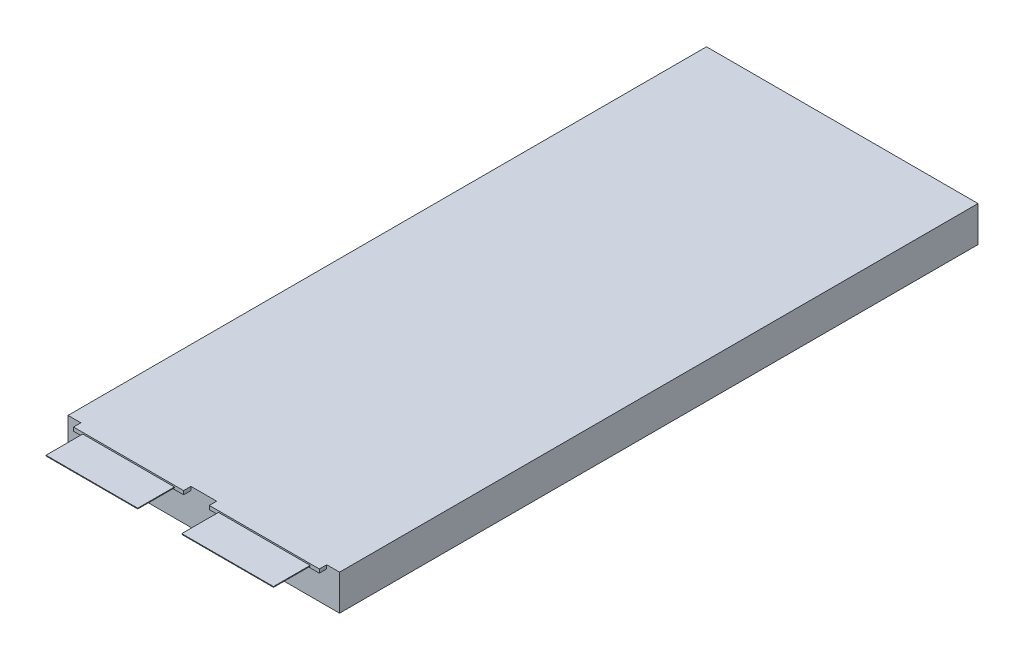
ISO-10303-21;
HEADER;
FILE_DESCRIPTION(('STEP AP214'),'2;1');
FILE_NAME('part.step','',(''),(''),'','','');
FILE_SCHEMA(('AUTOMOTIVE_DESIGN { 1 0 10303 214 1 1 1 1 }'));
ENDSEC;
DATA;
#1=APPLICATION_CONTEXT('core data for automotive mechanical design processes');
#2=APPLICATION_PROTOCOL_DEFINITION('international standard','automotive_design',2000,#1);
#3=PRODUCT_CONTEXT('',#1,'mechanical');
#4=PRODUCT('Part','Part','',(#3));
#5=PRODUCT_RELATED_PRODUCT_CATEGORY('part','',(#4));
#6=PRODUCT_DEFINITION_FORMATION('','',#4);
#7=PRODUCT_DEFINITION_CONTEXT('part definition',#1,'design');
#8=PRODUCT_DEFINITION('design','',#6,#7);
#9=PRODUCT_DEFINITION_SHAPE('','',#8);
#10=(LENGTH_UNIT() NAMED_UNIT(*) SI_UNIT(.MILLI.,.METRE.));
#11=(NAMED_UNIT(*) PLANE_ANGLE_UNIT() SI_UNIT($,.RADIAN.));
#12=(NAMED_UNIT(*) SI_UNIT($,.STERADIAN.) SOLID_ANGLE_UNIT());
#13=UNCERTAINTY_MEASURE_WITH_UNIT(LENGTH_MEASURE(1.E-05),#10,'distance_accuracy_value','');
#14=(GEOMETRIC_REPRESENTATION_CONTEXT(3) GLOBAL_UNCERTAINTY_ASSIGNED_CONTEXT((#13)) GLOBAL_UNIT_ASSIGNED_CONTEXT((#10,
#11,#12)) REPRESENTATION_CONTEXT('',''));
#15=CARTESIAN_POINT('',(0.,0.,0.));
#16=DIRECTION('',(0.,0.,1.));
#17=DIRECTION('',(1.,0.,0.));
#18=AXIS2_PLACEMENT_3D('',#15,#16,#17);
#19=CARTESIAN_POINT('',(0.,0.,176.));
#20=DIRECTION('',(0.,0.,1.));
#21=DIRECTION('',(1.,0.,0.));
#22=AXIS2_PLACEMENT_3D('',#19,#20,#21);
#23=PLANE('',#22);
#24=DIRECTION('',(1.,0.,0.));
#25=VECTOR('',#24,1.);
#26=CARTESIAN_POINT('',(40.5,-1.,176.));
#27=LINE('',#26,#25);
#28=CARTESIAN_POINT('',(40.5,-1.,176.));
#29=VERTEX_POINT('',#28);
#30=CARTESIAN_POINT('',(70.5,-1.,176.));
#31=VERTEX_POINT('',#30);
#32=EDGE_CURVE('E235',#29,#31,#27,.T.);
#33=ORIENTED_EDGE('',*,*,#32,.T.);
#34=DIRECTION('',(0.,1.,0.));
#35=VECTOR('',#34,1.);
#36=CARTESIAN_POINT('',(70.5,-1.,176.));
#37=LINE('',#36,#35);
#38=CARTESIAN_POINT('',(70.5,0.,176.));
#39=VERTEX_POINT('',#38);
#40=EDGE_CURVE('E238',#31,#39,#37,.T.);
#41=ORIENTED_EDGE('',*,*,#40,.T.);
#42=DIRECTION('',(-1.,0.,0.));
#43=VECTOR('',#42,1.);
#44=CARTESIAN_POINT('',(55.5,0.,176.));
#45=LINE('',#44,#43);
#46=CARTESIAN_POINT('',(40.5,0.,176.));
#47=VERTEX_POINT('',#46);
#48=EDGE_CURVE('E241',#39,#47,#45,.T.);
#49=ORIENTED_EDGE('',*,*,#48,.T.);
#50=DIRECTION('',(0.,-1.,0.));
#51=VECTOR('',#50,1.);
#52=CARTESIAN_POINT('',(40.5,0.,176.));
#53=LINE('',#52,#51);
#54=EDGE_CURVE('E243',#47,#29,#53,.T.);
#55=ORIENTED_EDGE('',*,*,#54,.T.);
#56=EDGE_LOOP('',(#33,#41,#49,#55));
#57=FACE_BOUND('',#56,.T.);
#58=DIRECTION('',(1.,0.,0.));
#59=VECTOR('',#58,1.);
#60=CARTESIAN_POINT('',(43.,-0.599999999999999,176.));
#61=LINE('',#60,#59);
#62=CARTESIAN_POINT('',(43.,-0.599999999999999,176.));
#63=VERTEX_POINT('',#62);
#64=CARTESIAN_POINT('',(68.,-0.599999999999999,176.));
#65=VERTEX_POINT('',#64);
#66=EDGE_CURVE('E52',#63,#65,#61,.T.);
#67=ORIENTED_EDGE('',*,*,#66,.F.);
#68=DIRECTION('',(0.,-1.,0.));
#69=VECTOR('',#68,1.);
#70=CARTESIAN_POINT('',(43.,-0.399999999999999,176.));
#71=LINE('',#70,#69);
#72=CARTESIAN_POINT('',(43.,-0.399999999999999,176.));
#73=VERTEX_POINT('',#72);
#74=EDGE_CURVE('E195',#73,#63,#71,.T.);
#75=ORIENTED_EDGE('',*,*,#74,.F.);
#76=DIRECTION('',(1.,0.,0.));
#77=VECTOR('',#76,1.);
#78=CARTESIAN_POINT('',(43.,-0.399999999999999,176.));
#79=LINE('',#78,#77);
#80=CARTESIAN_POINT('',(68.,-0.399999999999999,176.));
#81=VERTEX_POINT('',#80);
#82=EDGE_CURVE('E192',#73,#81,#79,.T.);
#83=ORIENTED_EDGE('',*,*,#82,.T.);
#84=DIRECTION('',(0.,-1.,0.));
#85=VECTOR('',#84,1.);
#86=CARTESIAN_POINT('',(68.,-0.399999999999999,176.));
#87=LINE('',#86,#85);
#88=EDGE_CURVE('E57',#81,#65,#87,.T.);
#89=ORIENTED_EDGE('',*,*,#88,.T.);
#90=EDGE_LOOP('',(#67,#75,#83,#89));
#91=FACE_BOUND('',#90,.T.);
#92=ADVANCED_FACE('F37',(#57,#91),#23,.T.);
#93=CARTESIAN_POINT('',(0.,0.,176.));
#94=DIRECTION('',(0.,0.,1.));
#95=DIRECTION('',(1.,0.,0.));
#96=AXIS2_PLACEMENT_3D('',#93,#94,#95);
#97=PLANE('',#96);
#98=DIRECTION('',(1.,0.,0.));
#99=VECTOR('',#98,1.);
#100=CARTESIAN_POINT('',(3.5,-1.,176.));
#101=LINE('',#100,#99);
#102=CARTESIAN_POINT('',(3.5,-1.,176.));
#103=VERTEX_POINT('',#102);
#104=CARTESIAN_POINT('',(33.5,-1.,176.));
#105=VERTEX_POINT('',#104);
#106=EDGE_CURVE('E261',#103,#105,#101,.T.);
#107=ORIENTED_EDGE('',*,*,#106,.T.);
#108=DIRECTION('',(0.,1.,0.));
#109=VECTOR('',#108,1.);
#110=CARTESIAN_POINT('',(33.5,-1.,176.));
#111=LINE('',#110,#109);
#112=CARTESIAN_POINT('',(33.5,0.,176.));
#113=VERTEX_POINT('',#112);
#114=EDGE_CURVE('E264',#105,#113,#111,.T.);
#115=ORIENTED_EDGE('',*,*,#114,.T.);
#116=DIRECTION('',(-1.,0.,0.));
#117=VECTOR('',#116,1.);
#118=CARTESIAN_POINT('',(18.5,0.,176.));
#119=LINE('',#118,#117);
#120=CARTESIAN_POINT('',(3.5,0.,176.));
#121=VERTEX_POINT('',#120);
#122=EDGE_CURVE('E267',#113,#121,#119,.T.);
#123=ORIENTED_EDGE('',*,*,#122,.T.);
#124=DIRECTION('',(0.,-1.,0.));
#125=VECTOR('',#124,1.);
#126=CARTESIAN_POINT('',(3.5,0.,176.));
#127=LINE('',#126,#125);
#128=EDGE_CURVE('E269',#121,#103,#127,.T.);
#129=ORIENTED_EDGE('',*,*,#128,.T.);
#130=EDGE_LOOP('',(#107,#115,#123,#129));
#131=FACE_BOUND('',#130,.T.);
#132=DIRECTION('',(1.,0.,0.));
#133=VECTOR('',#132,1.);
#134=CARTESIAN_POINT('',(6.,-0.600000000000005,176.));
#135=LINE('',#134,#133);
#136=CARTESIAN_POINT('',(6.,-0.600000000000005,176.));
#137=VERTEX_POINT('',#136);
#138=CARTESIAN_POINT('',(31.,-0.600000000000005,176.));
#139=VERTEX_POINT('',#138);
#140=EDGE_CURVE('E199',#137,#139,#135,.T.);
#141=ORIENTED_EDGE('',*,*,#140,.F.);
#142=DIRECTION('',(0.,-1.,0.));
#143=VECTOR('',#142,1.);
#144=CARTESIAN_POINT('',(6.,-0.400000000000005,176.));
#145=LINE('',#144,#143);
#146=CARTESIAN_POINT('',(6.,-0.400000000000005,176.));
#147=VERTEX_POINT('',#146);
#148=EDGE_CURVE('E196',#147,#137,#145,.T.);
#149=ORIENTED_EDGE('',*,*,#148,.F.);
#150=DIRECTION('',(1.,0.,0.));
#151=VECTOR('',#150,1.);
#152=CARTESIAN_POINT('',(6.,-0.400000000000005,176.));
#153=LINE('',#152,#151);
#154=CARTESIAN_POINT('',(31.,-0.400000000000005,176.));
#155=VERTEX_POINT('',#154);
#156=EDGE_CURVE('E209',#147,#155,#153,.T.);
#157=ORIENTED_EDGE('',*,*,#156,.T.);
#158=DIRECTION('',(0.,-1.,0.));
#159=VECTOR('',#158,1.);
#160=CARTESIAN_POINT('',(31.,-0.400000000000005,176.));
#161=LINE('',#160,#159);
#162=EDGE_CURVE('E220',#155,#139,#161,.T.);
#163=ORIENTED_EDGE('',*,*,#162,.T.);
#164=EDGE_LOOP('',(#141,#149,#157,#163));
#165=FACE_BOUND('',#164,.T.);
#166=ADVANCED_FACE('F350',(#131,#165),#97,.T.);
#167=CARTESIAN_POINT('',(0.,0.,174.));
#168=DIRECTION('',(0.,0.,1.));
#169=DIRECTION('',(1.,0.,0.));
#170=AXIS2_PLACEMENT_3D('',#167,#168,#169);
#171=PLANE('',#170);
#172=DIRECTION('',(-1.,0.,0.));
#173=VECTOR('',#172,1.);
#174=CARTESIAN_POINT('',(0.,0.,174.));
#175=LINE('',#174,#173);
#176=CARTESIAN_POINT('',(74.,0.,174.));
#177=VERTEX_POINT('',#176);
#178=CARTESIAN_POINT('',(70.5,0.,174.));
#179=VERTEX_POINT('',#178);
#180=EDGE_CURVE('E300',#177,#179,#175,.T.);
#181=ORIENTED_EDGE('',*,*,#180,.T.);
#182=DIRECTION('',(0.,1.,0.));
#183=VECTOR('',#182,1.);
#184=CARTESIAN_POINT('',(70.5,-1.,174.));
#185=LINE('',#184,#183);
#186=CARTESIAN_POINT('',(70.5,-1.,174.));
#187=VERTEX_POINT('',#186);
#188=EDGE_CURVE('E248',#187,#179,#185,.T.);
#189=ORIENTED_EDGE('',*,*,#188,.F.);
#190=DIRECTION('',(1.,0.,0.));
#191=VECTOR('',#190,1.);
#192=CARTESIAN_POINT('',(40.5,-1.,174.));
#193=LINE('',#192,#191);
#194=CARTESIAN_POINT('',(40.5,-1.,174.));
#195=VERTEX_POINT('',#194);
#196=EDGE_CURVE('E234',#195,#187,#193,.T.);
#197=ORIENTED_EDGE('',*,*,#196,.F.);
#198=DIRECTION('',(0.,-1.,0.));
#199=VECTOR('',#198,1.);
#200=CARTESIAN_POINT('',(40.5,0.,174.));
#201=LINE('',#200,#199);
#202=CARTESIAN_POINT('',(40.5,0.,174.));
#203=VERTEX_POINT('',#202);
#204=EDGE_CURVE('E239',#203,#195,#201,.T.);
#205=ORIENTED_EDGE('',*,*,#204,.F.);
#206=CARTESIAN_POINT('',(33.5,0.,174.));
#207=VERTEX_POINT('',#206);
#208=EDGE_CURVE('E304',#203,#207,#175,.T.);
#209=ORIENTED_EDGE('',*,*,#208,.T.);
#210=DIRECTION('',(0.,1.,0.));
#211=VECTOR('',#210,1.);
#212=CARTESIAN_POINT('',(33.5,-1.,174.));
#213=LINE('',#212,#211);
#214=CARTESIAN_POINT('',(33.5,-1.,174.));
#215=VERTEX_POINT('',#214);
#216=EDGE_CURVE('E274',#215,#207,#213,.T.);
#217=ORIENTED_EDGE('',*,*,#216,.F.);
#218=DIRECTION('',(1.,0.,0.));
#219=VECTOR('',#218,1.);
#220=CARTESIAN_POINT('',(3.5,-1.,174.));
#221=LINE('',#220,#219);
#222=CARTESIAN_POINT('',(3.5,-1.,174.));
#223=VERTEX_POINT('',#222);
#224=EDGE_CURVE('E260',#223,#215,#221,.T.);
#225=ORIENTED_EDGE('',*,*,#224,.F.);
#226=DIRECTION('',(0.,-1.,0.));
#227=VECTOR('',#226,1.);
#228=CARTESIAN_POINT('',(3.5,0.,174.));
#229=LINE('',#228,#227);
#230=CARTESIAN_POINT('',(3.5,0.,174.));
#231=VERTEX_POINT('',#230);
#232=EDGE_CURVE('E265',#231,#223,#229,.T.);
#233=ORIENTED_EDGE('',*,*,#232,.F.);
#234=CARTESIAN_POINT('',(0.,0.,174.));
#235=VERTEX_POINT('',#234);
#236=EDGE_CURVE('E299',#231,#235,#175,.T.);
#237=ORIENTED_EDGE('',*,*,#236,.T.);
#238=DIRECTION('',(0.,-1.,0.));
#239=VECTOR('',#238,1.);
#240=CARTESIAN_POINT('',(0.,0.,174.));
#241=LINE('',#240,#239);
#242=CARTESIAN_POINT('',(0.,-9.7,174.));
#243=VERTEX_POINT('',#242);
#244=EDGE_CURVE('E291',#235,#243,#241,.T.);
#245=ORIENTED_EDGE('',*,*,#244,.T.);
#246=DIRECTION('',(1.,0.,0.));
#247=VECTOR('',#246,1.);
#248=CARTESIAN_POINT('',(0.,-9.7,174.));
#249=LINE('',#248,#247);
#250=CARTESIAN_POINT('',(74.,-9.7,174.));
#251=VERTEX_POINT('',#250);
#252=EDGE_CURVE('E294',#243,#251,#249,.T.);
#253=ORIENTED_EDGE('',*,*,#252,.T.);
#254=DIRECTION('',(0.,1.,0.));
#255=VECTOR('',#254,1.);
#256=CARTESIAN_POINT('',(74.,0.,174.));
#257=LINE('',#256,#255);
#258=EDGE_CURVE('E297',#251,#177,#257,.T.);
#259=ORIENTED_EDGE('',*,*,#258,.T.);
#260=EDGE_LOOP('',(#181,#189,#197,#205,#209,#217,#225,#233,#237,#245,#253,#259));
#261=FACE_BOUND('',#260,.T.);
#262=ADVANCED_FACE('F337',(#261),#171,.T.);
#263=CARTESIAN_POINT('',(0.,0.,174.));
#264=DIRECTION('',(1.,0.,0.));
#265=DIRECTION('',(0.,1.,0.));
#266=AXIS2_PLACEMENT_3D('',#263,#264,#265);
#267=PLANE('',#266);
#268=DIRECTION('',(0.,-1.,0.));
#269=VECTOR('',#268,1.);
#270=CARTESIAN_POINT('',(0.,0.,0.));
#271=LINE('',#270,#269);
#272=CARTESIAN_POINT('',(0.,0.,0.));
#273=VERTEX_POINT('',#272);
#274=CARTESIAN_POINT('',(0.,-9.7,0.));
#275=VERTEX_POINT('',#274);
#276=EDGE_CURVE('E290',#273,#275,#271,.T.);
#277=ORIENTED_EDGE('',*,*,#276,.T.);
#278=DIRECTION('',(0.,0.,-1.));
#279=VECTOR('',#278,1.);
#280=CARTESIAN_POINT('',(0.,-9.7,174.));
#281=LINE('',#280,#279);
#282=EDGE_CURVE('E11',#243,#275,#281,.T.);
#283=ORIENTED_EDGE('',*,*,#282,.F.);
#284=ORIENTED_EDGE('',*,*,#244,.F.);
#285=DIRECTION('',(0.,0.,-1.));
#286=VECTOR('',#285,1.);
#287=CARTESIAN_POINT('',(0.,0.,174.));
#288=LINE('',#287,#286);
#289=EDGE_CURVE('E303',#235,#273,#288,.T.);
#290=ORIENTED_EDGE('',*,*,#289,.T.);
#291=EDGE_LOOP('',(#277,#283,#284,#290));
#292=FACE_BOUND('',#291,.T.);
#293=ADVANCED_FACE('F39',(#292),#267,.F.);
#294=CARTESIAN_POINT('',(0.,-9.7,174.));
#295=DIRECTION('',(0.,1.,0.));
#296=DIRECTION('',(0.,0.,1.));
#297=AXIS2_PLACEMENT_3D('',#294,#295,#296);
#298=PLANE('',#297);
#299=DIRECTION('',(1.,0.,0.));
#300=VECTOR('',#299,1.);
#301=CARTESIAN_POINT('',(0.,-9.7,0.));
#302=LINE('',#301,#300);
#303=CARTESIAN_POINT('',(74.,-9.7,0.));
#304=VERTEX_POINT('',#303);
#305=EDGE_CURVE('E307',#275,#304,#302,.T.);
#306=ORIENTED_EDGE('',*,*,#305,.T.);
#307=DIRECTION('',(0.,0.,-1.));
#308=VECTOR('',#307,1.);
#309=CARTESIAN_POINT('',(74.,-9.7,174.));
#310=LINE('',#309,#308);
#311=EDGE_CURVE('E45',#251,#304,#310,.T.);
#312=ORIENTED_EDGE('',*,*,#311,.F.);
#313=ORIENTED_EDGE('',*,*,#252,.F.);
#314=ORIENTED_EDGE('',*,*,#282,.T.);
#315=EDGE_LOOP('',(#306,#312,#313,#314));
#316=FACE_BOUND('',#315,.T.);
#317=ADVANCED_FACE('F563',(#316),#298,.F.);
#318=CARTESIAN_POINT('',(74.,0.,174.));
#319=DIRECTION('',(-1.,0.,0.));
#320=DIRECTION('',(0.,0.,1.));
#321=AXIS2_PLACEMENT_3D('',#318,#319,#320);
#322=PLANE('',#321);
#323=DIRECTION('',(0.,1.,0.));
#324=VECTOR('',#323,1.);
#325=CARTESIAN_POINT('',(74.,0.,0.));
#326=LINE('',#325,#324);
#327=CARTESIAN_POINT('',(74.,0.,0.));
#328=VERTEX_POINT('',#327);
#329=EDGE_CURVE('E309',#304,#328,#326,.T.);
#330=ORIENTED_EDGE('',*,*,#329,.T.);
#331=DIRECTION('',(0.,0.,-1.));
#332=VECTOR('',#331,1.);
#333=CARTESIAN_POINT('',(74.,0.,174.));
#334=LINE('',#333,#332);
#335=EDGE_CURVE('E314',#177,#328,#334,.T.);
#336=ORIENTED_EDGE('',*,*,#335,.F.);
#337=ORIENTED_EDGE('',*,*,#258,.F.);
#338=ORIENTED_EDGE('',*,*,#311,.T.);
#339=EDGE_LOOP('',(#330,#336,#337,#338));
#340=FACE_BOUND('',#339,.T.);
#341=ADVANCED_FACE('F321',(#340),#322,.F.);
#342=CARTESIAN_POINT('',(0.,0.,174.));
#343=DIRECTION('',(0.,-1.,0.));
#344=DIRECTION('',(0.,0.,-1.));
#345=AXIS2_PLACEMENT_3D('',#342,#343,#344);
#346=PLANE('',#345);
#347=DIRECTION('',(-1.,0.,0.));
#348=VECTOR('',#347,1.);
#349=CARTESIAN_POINT('',(0.,0.,0.));
#350=LINE('',#349,#348);
#351=EDGE_CURVE('E295',#328,#273,#350,.T.);
#352=ORIENTED_EDGE('',*,*,#351,.T.);
#353=ORIENTED_EDGE('',*,*,#289,.F.);
#354=ORIENTED_EDGE('',*,*,#236,.F.);
#355=DIRECTION('',(0.,0.,-1.));
#356=VECTOR('',#355,1.);
#357=CARTESIAN_POINT('',(3.5,0.,176.));
#358=LINE('',#357,#356);
#359=EDGE_CURVE('E281',#121,#231,#358,.T.);
#360=ORIENTED_EDGE('',*,*,#359,.F.);
#361=ORIENTED_EDGE('',*,*,#122,.F.);
#362=DIRECTION('',(0.,0.,-1.));
#363=VECTOR('',#362,1.);
#364=CARTESIAN_POINT('',(33.5,0.,176.));
#365=LINE('',#364,#363);
#366=EDGE_CURVE('E284',#113,#207,#365,.T.);
#367=ORIENTED_EDGE('',*,*,#366,.T.);
#368=ORIENTED_EDGE('',*,*,#208,.F.);
#369=DIRECTION('',(0.,0.,-1.));
#370=VECTOR('',#369,1.);
#371=CARTESIAN_POINT('',(40.5,0.,176.));
#372=LINE('',#371,#370);
#373=EDGE_CURVE('E253',#47,#203,#372,.T.);
#374=ORIENTED_EDGE('',*,*,#373,.F.);
#375=ORIENTED_EDGE('',*,*,#48,.F.);
#376=DIRECTION('',(0.,0.,-1.));
#377=VECTOR('',#376,1.);
#378=CARTESIAN_POINT('',(70.5,0.,176.));
#379=LINE('',#378,#377);
#380=EDGE_CURVE('E255',#39,#179,#379,.T.);
#381=ORIENTED_EDGE('',*,*,#380,.T.);
#382=ORIENTED_EDGE('',*,*,#180,.F.);
#383=ORIENTED_EDGE('',*,*,#335,.T.);
#384=EDGE_LOOP('',(#352,#353,#354,#360,#361,#367,#368,#374,#375,#381,#382,#383));
#385=FACE_BOUND('',#384,.T.);
#386=ADVANCED_FACE('F330',(#385),#346,.F.);
#387=CARTESIAN_POINT('',(0.,0.,0.));
#388=DIRECTION('',(0.,0.,1.));
#389=DIRECTION('',(1.,0.,0.));
#390=AXIS2_PLACEMENT_3D('',#387,#388,#389);
#391=PLANE('',#390);
#392=ORIENTED_EDGE('',*,*,#276,.F.);
#393=ORIENTED_EDGE('',*,*,#351,.F.);
#394=ORIENTED_EDGE('',*,*,#329,.F.);
#395=ORIENTED_EDGE('',*,*,#305,.F.);
#396=EDGE_LOOP('',(#392,#393,#394,#395));
#397=FACE_BOUND('',#396,.T.);
#398=ADVANCED_FACE('F327',(#397),#391,.F.);
#399=CARTESIAN_POINT('',(3.5,-1.,176.));
#400=DIRECTION('',(0.,1.,0.));
#401=DIRECTION('',(0.,0.,1.));
#402=AXIS2_PLACEMENT_3D('',#399,#400,#401);
#403=PLANE('',#402);
#404=ORIENTED_EDGE('',*,*,#224,.T.);
#405=DIRECTION('',(0.,0.,-1.));
#406=VECTOR('',#405,1.);
#407=CARTESIAN_POINT('',(33.5,-1.,176.));
#408=LINE('',#407,#406);
#409=EDGE_CURVE('E287',#105,#215,#408,.T.);
#410=ORIENTED_EDGE('',*,*,#409,.F.);
#411=ORIENTED_EDGE('',*,*,#106,.F.);
#412=DIRECTION('',(0.,0.,-1.));
#413=VECTOR('',#412,1.);
#414=CARTESIAN_POINT('',(3.5,-1.,176.));
#415=LINE('',#414,#413);
#416=EDGE_CURVE('E271',#103,#223,#415,.T.);
#417=ORIENTED_EDGE('',*,*,#416,.T.);
#418=EDGE_LOOP('',(#404,#410,#411,#417));
#419=FACE_BOUND('',#418,.T.);
#420=ADVANCED_FACE('F355',(#419),#403,.F.);
#421=CARTESIAN_POINT('',(33.5,-1.,176.));
#422=DIRECTION('',(-1.,0.,0.));
#423=DIRECTION('',(0.,0.,1.));
#424=AXIS2_PLACEMENT_3D('',#421,#422,#423);
#425=PLANE('',#424);
#426=ORIENTED_EDGE('',*,*,#216,.T.);
#427=ORIENTED_EDGE('',*,*,#366,.F.);
#428=ORIENTED_EDGE('',*,*,#114,.F.);
#429=ORIENTED_EDGE('',*,*,#409,.T.);
#430=EDGE_LOOP('',(#426,#427,#428,#429));
#431=FACE_BOUND('',#430,.T.);
#432=ADVANCED_FACE('F345',(#431),#425,.F.);
#433=CARTESIAN_POINT('',(3.5,0.,176.));
#434=DIRECTION('',(1.,0.,0.));
#435=DIRECTION('',(0.,0.,-1.));
#436=AXIS2_PLACEMENT_3D('',#433,#434,#435);
#437=PLANE('',#436);
#438=ORIENTED_EDGE('',*,*,#232,.T.);
#439=ORIENTED_EDGE('',*,*,#416,.F.);
#440=ORIENTED_EDGE('',*,*,#128,.F.);
#441=ORIENTED_EDGE('',*,*,#359,.T.);
#442=EDGE_LOOP('',(#438,#439,#440,#441));
#443=FACE_BOUND('',#442,.T.);
#444=ADVANCED_FACE('F357',(#443),#437,.F.);
#445=CARTESIAN_POINT('',(40.5,-1.,176.));
#446=DIRECTION('',(0.,1.,0.));
#447=DIRECTION('',(0.,0.,1.));
#448=AXIS2_PLACEMENT_3D('',#445,#446,#447);
#449=PLANE('',#448);
#450=ORIENTED_EDGE('',*,*,#196,.T.);
#451=DIRECTION('',(0.,0.,-1.));
#452=VECTOR('',#451,1.);
#453=CARTESIAN_POINT('',(70.5,-1.,176.));
#454=LINE('',#453,#452);
#455=EDGE_CURVE('E258',#31,#187,#454,.T.);
#456=ORIENTED_EDGE('',*,*,#455,.F.);
#457=ORIENTED_EDGE('',*,*,#32,.F.);
#458=DIRECTION('',(0.,0.,-1.));
#459=VECTOR('',#458,1.);
#460=CARTESIAN_POINT('',(40.5,-1.,176.));
#461=LINE('',#460,#459);
#462=EDGE_CURVE('E245',#29,#195,#461,.T.);
#463=ORIENTED_EDGE('',*,*,#462,.T.);
#464=EDGE_LOOP('',(#450,#456,#457,#463));
#465=FACE_BOUND('',#464,.T.);
#466=ADVANCED_FACE('F359',(#465),#449,.F.);
#467=CARTESIAN_POINT('',(70.5,-1.,176.));
#468=DIRECTION('',(-1.,0.,0.));
#469=DIRECTION('',(0.,0.,1.));
#470=AXIS2_PLACEMENT_3D('',#467,#468,#469);
#471=PLANE('',#470);
#472=ORIENTED_EDGE('',*,*,#188,.T.);
#473=ORIENTED_EDGE('',*,*,#380,.F.);
#474=ORIENTED_EDGE('',*,*,#40,.F.);
#475=ORIENTED_EDGE('',*,*,#455,.T.);
#476=EDGE_LOOP('',(#472,#473,#474,#475));
#477=FACE_BOUND('',#476,.T.);
#478=ADVANCED_FACE('F365',(#477),#471,.F.);
#479=CARTESIAN_POINT('',(40.5,0.,176.));
#480=DIRECTION('',(1.,0.,0.));
#481=DIRECTION('',(0.,0.,-1.));
#482=AXIS2_PLACEMENT_3D('',#479,#480,#481);
#483=PLANE('',#482);
#484=ORIENTED_EDGE('',*,*,#204,.T.);
#485=ORIENTED_EDGE('',*,*,#462,.F.);
#486=ORIENTED_EDGE('',*,*,#54,.F.);
#487=ORIENTED_EDGE('',*,*,#373,.T.);
#488=EDGE_LOOP('',(#484,#485,#486,#487));
#489=FACE_BOUND('',#488,.T.);
#490=ADVANCED_FACE('F380',(#489),#483,.F.);
#491=CARTESIAN_POINT('',(6.,-0.400000000000005,186.));
#492=DIRECTION('',(1.,0.,0.));
#493=DIRECTION('',(0.,0.,-1.));
#494=AXIS2_PLACEMENT_3D('',#491,#492,#493);
#495=PLANE('',#494);
#496=ORIENTED_EDGE('',*,*,#148,.T.);
#497=DIRECTION('',(0.,0.,-1.));
#498=VECTOR('',#497,1.);
#499=CARTESIAN_POINT('',(6.,-0.600000000000005,186.));
#500=LINE('',#499,#498);
#501=CARTESIAN_POINT('',(6.,-0.600000000000005,186.));
#502=VERTEX_POINT('',#501);
#503=EDGE_CURVE('E231',#502,#137,#500,.T.);
#504=ORIENTED_EDGE('',*,*,#503,.F.);
#505=DIRECTION('',(0.,-1.,0.));
#506=VECTOR('',#505,1.);
#507=CARTESIAN_POINT('',(6.,-0.400000000000005,186.));
#508=LINE('',#507,#506);
#509=CARTESIAN_POINT('',(6.,-0.400000000000005,186.));
#510=VERTEX_POINT('',#509);
#511=EDGE_CURVE('E205',#510,#502,#508,.T.);
#512=ORIENTED_EDGE('',*,*,#511,.F.);
#513=DIRECTION('',(0.,0.,-1.));
#514=VECTOR('',#513,1.);
#515=CARTESIAN_POINT('',(6.,-0.400000000000005,186.));
#516=LINE('',#515,#514);
#517=EDGE_CURVE('E216',#510,#147,#516,.T.);
#518=ORIENTED_EDGE('',*,*,#517,.T.);
#519=EDGE_LOOP('',(#496,#504,#512,#518));
#520=FACE_BOUND('',#519,.T.);
#521=ADVANCED_FACE('F378',(#520),#495,.F.);
#522=CARTESIAN_POINT('',(6.,-0.600000000000005,186.));
#523=DIRECTION('',(0.,1.,0.));
#524=DIRECTION('',(0.,0.,1.));
#525=AXIS2_PLACEMENT_3D('',#522,#523,#524);
#526=PLANE('',#525);
#527=ORIENTED_EDGE('',*,*,#140,.T.);
#528=DIRECTION('',(0.,0.,-1.));
#529=VECTOR('',#528,1.);
#530=CARTESIAN_POINT('',(31.,-0.600000000000005,186.));
#531=LINE('',#530,#529);
#532=CARTESIAN_POINT('',(31.,-0.600000000000005,186.));
#533=VERTEX_POINT('',#532);
#534=EDGE_CURVE('E228',#533,#139,#531,.T.);
#535=ORIENTED_EDGE('',*,*,#534,.F.);
#536=DIRECTION('',(1.,0.,0.));
#537=VECTOR('',#536,1.);
#538=CARTESIAN_POINT('',(6.,-0.600000000000005,186.));
#539=LINE('',#538,#537);
#540=EDGE_CURVE('E208',#502,#533,#539,.T.);
#541=ORIENTED_EDGE('',*,*,#540,.F.);
#542=ORIENTED_EDGE('',*,*,#503,.T.);
#543=EDGE_LOOP('',(#527,#535,#541,#542));
#544=FACE_BOUND('',#543,.T.);
#545=ADVANCED_FACE('F408',(#544),#526,.F.);
#546=CARTESIAN_POINT('',(31.,-0.400000000000005,186.));
#547=DIRECTION('',(1.,0.,0.));
#548=DIRECTION('',(0.,0.,-1.));
#549=AXIS2_PLACEMENT_3D('',#546,#547,#548);
#550=PLANE('',#549);
#551=ORIENTED_EDGE('',*,*,#162,.F.);
#552=DIRECTION('',(0.,0.,-1.));
#553=VECTOR('',#552,1.);
#554=CARTESIAN_POINT('',(31.,-0.400000000000005,186.));
#555=LINE('',#554,#553);
#556=CARTESIAN_POINT('',(31.,-0.400000000000005,186.));
#557=VERTEX_POINT('',#556);
#558=EDGE_CURVE('E225',#557,#155,#555,.T.);
#559=ORIENTED_EDGE('',*,*,#558,.F.);
#560=DIRECTION('',(0.,-1.,0.));
#561=VECTOR('',#560,1.);
#562=CARTESIAN_POINT('',(31.,-0.400000000000005,186.));
#563=LINE('',#562,#561);
#564=EDGE_CURVE('E211',#557,#533,#563,.T.);
#565=ORIENTED_EDGE('',*,*,#564,.T.);
#566=ORIENTED_EDGE('',*,*,#534,.T.);
#567=EDGE_LOOP('',(#551,#559,#565,#566));
#568=FACE_BOUND('',#567,.T.);
#569=ADVANCED_FACE('F415',(#568),#550,.T.);
#570=CARTESIAN_POINT('',(6.,-0.400000000000005,186.));
#571=DIRECTION('',(0.,1.,0.));
#572=DIRECTION('',(0.,0.,1.));
#573=AXIS2_PLACEMENT_3D('',#570,#571,#572);
#574=PLANE('',#573);
#575=ORIENTED_EDGE('',*,*,#156,.F.);
#576=ORIENTED_EDGE('',*,*,#517,.F.);
#577=DIRECTION('',(1.,0.,0.));
#578=VECTOR('',#577,1.);
#579=CARTESIAN_POINT('',(6.,-0.400000000000005,186.));
#580=LINE('',#579,#578);
#581=EDGE_CURVE('E214',#510,#557,#580,.T.);
#582=ORIENTED_EDGE('',*,*,#581,.T.);
#583=ORIENTED_EDGE('',*,*,#558,.T.);
#584=EDGE_LOOP('',(#575,#576,#582,#583));
#585=FACE_BOUND('',#584,.T.);
#586=ADVANCED_FACE('F422',(#585),#574,.T.);
#587=CARTESIAN_POINT('',(0.,0.,186.));
#588=DIRECTION('',(0.,0.,1.));
#589=DIRECTION('',(1.,0.,0.));
#590=AXIS2_PLACEMENT_3D('',#587,#588,#589);
#591=PLANE('',#590);
#592=ORIENTED_EDGE('',*,*,#511,.T.);
#593=ORIENTED_EDGE('',*,*,#540,.T.);
#594=ORIENTED_EDGE('',*,*,#564,.F.);
#595=ORIENTED_EDGE('',*,*,#581,.F.);
#596=EDGE_LOOP('',(#592,#593,#594,#595));
#597=FACE_BOUND('',#596,.T.);
#598=ADVANCED_FACE('F430',(#597),#591,.T.);
#599=CARTESIAN_POINT('',(43.,-0.399999999999999,186.));
#600=DIRECTION('',(1.,0.,0.));
#601=DIRECTION('',(0.,0.,-1.));
#602=AXIS2_PLACEMENT_3D('',#599,#600,#601);
#603=PLANE('',#602);
#604=ORIENTED_EDGE('',*,*,#74,.T.);
#605=DIRECTION('',(0.,0.,-1.));
#606=VECTOR('',#605,1.);
#607=CARTESIAN_POINT('',(43.,-0.599999999999999,186.));
#608=LINE('',#607,#606);
#609=CARTESIAN_POINT('',(43.,-0.599999999999999,186.));
#610=VERTEX_POINT('',#609);
#611=EDGE_CURVE('E176',#610,#63,#608,.T.);
#612=ORIENTED_EDGE('',*,*,#611,.F.);
#613=DIRECTION('',(0.,-1.,0.));
#614=VECTOR('',#613,1.);
#615=CARTESIAN_POINT('',(43.,-0.399999999999999,186.));
#616=LINE('',#615,#614);
#617=CARTESIAN_POINT('',(43.,-0.399999999999999,186.));
#618=VERTEX_POINT('',#617);
#619=EDGE_CURVE('E183',#618,#610,#616,.T.);
#620=ORIENTED_EDGE('',*,*,#619,.F.);
#621=DIRECTION('',(0.,0.,-1.));
#622=VECTOR('',#621,1.);
#623=CARTESIAN_POINT('',(43.,-0.399999999999999,186.));
#624=LINE('',#623,#622);
#625=EDGE_CURVE('E591',#618,#73,#624,.T.);
#626=ORIENTED_EDGE('',*,*,#625,.T.);
#627=EDGE_LOOP('',(#604,#612,#620,#626));
#628=FACE_BOUND('',#627,.T.);
#629=ADVANCED_FACE('F194',(#628),#603,.F.);
#630=CARTESIAN_POINT('',(43.,-0.599999999999999,186.));
#631=DIRECTION('',(0.,1.,0.));
#632=DIRECTION('',(0.,0.,1.));
#633=AXIS2_PLACEMENT_3D('',#630,#631,#632);
#634=PLANE('',#633);
#635=ORIENTED_EDGE('',*,*,#66,.T.);
#636=DIRECTION('',(0.,0.,-1.));
#637=VECTOR('',#636,1.);
#638=CARTESIAN_POINT('',(68.,-0.599999999999999,186.));
#639=LINE('',#638,#637);
#640=CARTESIAN_POINT('',(68.,-0.599999999999999,186.));
#641=VERTEX_POINT('',#640);
#642=EDGE_CURVE('E178',#641,#65,#639,.T.);
#643=ORIENTED_EDGE('',*,*,#642,.F.);
#644=DIRECTION('',(1.,0.,0.));
#645=VECTOR('',#644,1.);
#646=CARTESIAN_POINT('',(43.,-0.599999999999999,186.));
#647=LINE('',#646,#645);
#648=EDGE_CURVE('E172',#610,#641,#647,.T.);
#649=ORIENTED_EDGE('',*,*,#648,.F.);
#650=ORIENTED_EDGE('',*,*,#611,.T.);
#651=EDGE_LOOP('',(#635,#643,#649,#650));
#652=FACE_BOUND('',#651,.T.);
#653=ADVANCED_FACE('F174',(#652),#634,.F.);
#654=CARTESIAN_POINT('',(68.,-0.399999999999999,186.));
#655=DIRECTION('',(1.,0.,0.));
#656=DIRECTION('',(0.,0.,-1.));
#657=AXIS2_PLACEMENT_3D('',#654,#655,#656);
#658=PLANE('',#657);
#659=ORIENTED_EDGE('',*,*,#88,.F.);
#660=DIRECTION('',(0.,0.,-1.));
#661=VECTOR('',#660,1.);
#662=CARTESIAN_POINT('',(68.,-0.399999999999999,186.));
#663=LINE('',#662,#661);
#664=CARTESIAN_POINT('',(68.,-0.399999999999999,186.));
#665=VERTEX_POINT('',#664);
#666=EDGE_CURVE('E201',#665,#81,#663,.T.);
#667=ORIENTED_EDGE('',*,*,#666,.F.);
#668=DIRECTION('',(0.,-1.,0.));
#669=VECTOR('',#668,1.);
#670=CARTESIAN_POINT('',(68.,-0.399999999999999,186.));
#671=LINE('',#670,#669);
#672=EDGE_CURVE('E182',#665,#641,#671,.T.);
#673=ORIENTED_EDGE('',*,*,#672,.T.);
#674=ORIENTED_EDGE('',*,*,#642,.T.);
#675=EDGE_LOOP('',(#659,#667,#673,#674));
#676=FACE_BOUND('',#675,.T.);
#677=ADVANCED_FACE('F451',(#676),#658,.T.);
#678=CARTESIAN_POINT('',(43.,-0.399999999999999,186.));
#679=DIRECTION('',(0.,1.,0.));
#680=DIRECTION('',(0.,0.,1.));
#681=AXIS2_PLACEMENT_3D('',#678,#679,#680);
#682=PLANE('',#681);
#683=ORIENTED_EDGE('',*,*,#82,.F.);
#684=ORIENTED_EDGE('',*,*,#625,.F.);
#685=DIRECTION('',(1.,0.,0.));
#686=VECTOR('',#685,1.);
#687=CARTESIAN_POINT('',(43.,-0.399999999999999,186.));
#688=LINE('',#687,#686);
#689=EDGE_CURVE('E189',#618,#665,#688,.T.);
#690=ORIENTED_EDGE('',*,*,#689,.T.);
#691=ORIENTED_EDGE('',*,*,#666,.T.);
#692=EDGE_LOOP('',(#683,#684,#690,#691));
#693=FACE_BOUND('',#692,.T.);
#694=ADVANCED_FACE('F458',(#693),#682,.T.);
#695=CARTESIAN_POINT('',(0.,0.,186.));
#696=DIRECTION('',(0.,0.,1.));
#697=DIRECTION('',(1.,0.,0.));
#698=AXIS2_PLACEMENT_3D('',#695,#696,#697);
#699=PLANE('',#698);
#700=ORIENTED_EDGE('',*,*,#619,.T.);
#701=ORIENTED_EDGE('',*,*,#648,.T.);
#702=ORIENTED_EDGE('',*,*,#672,.F.);
#703=ORIENTED_EDGE('',*,*,#689,.F.);
#704=EDGE_LOOP('',(#700,#701,#702,#703));
#705=FACE_BOUND('',#704,.T.);
#706=ADVANCED_FACE('F187',(#705),#699,.T.);
#707=CLOSED_SHELL('',(#92,#166,#262,#293,#317,#341,#386,#398,#420,#432,#444,#466,#478,#490,#521,
#545,#569,#586,#598,#629,#653,#677,#694,#706));
#708=MANIFOLD_SOLID_BREP('B2',#707);
#709=ADVANCED_BREP_SHAPE_REPRESENTATION('',(#18,#708),#14);
#710=SHAPE_DEFINITION_REPRESENTATION(#9,#709);
ENDSEC;
END-ISO-10303-21;
